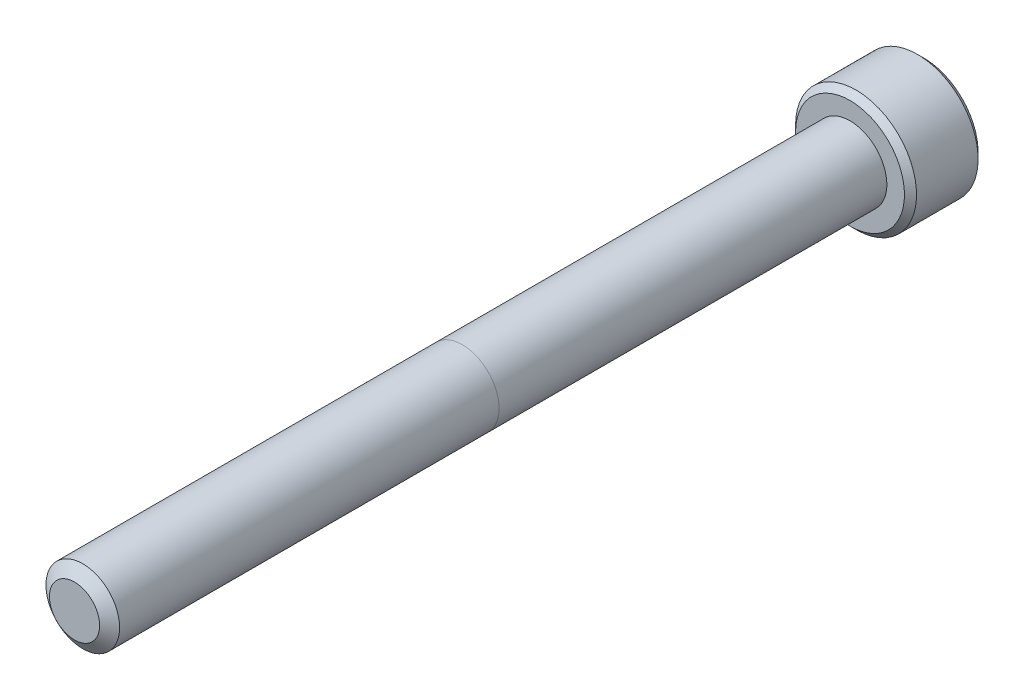
ISO-10303-21;
HEADER;
FILE_DESCRIPTION(('STEP AP214'),'2;1');
FILE_NAME('part.step','',(''),(''),'','','');
FILE_SCHEMA(('AUTOMOTIVE_DESIGN { 1 0 10303 214 1 1 1 1 }'));
ENDSEC;
DATA;
#1=APPLICATION_CONTEXT('core data for automotive mechanical design processes');
#2=APPLICATION_PROTOCOL_DEFINITION('international standard','automotive_design',2000,#1);
#3=PRODUCT_CONTEXT('',#1,'mechanical');
#4=PRODUCT('Part','Part','',(#3));
#5=PRODUCT_RELATED_PRODUCT_CATEGORY('part','',(#4));
#6=PRODUCT_DEFINITION_FORMATION('','',#4);
#7=PRODUCT_DEFINITION_CONTEXT('part definition',#1,'design');
#8=PRODUCT_DEFINITION('design','',#6,#7);
#9=PRODUCT_DEFINITION_SHAPE('','',#8);
#10=(LENGTH_UNIT() NAMED_UNIT(*) SI_UNIT(.MILLI.,.METRE.));
#11=(NAMED_UNIT(*) PLANE_ANGLE_UNIT() SI_UNIT($,.RADIAN.));
#12=(NAMED_UNIT(*) SI_UNIT($,.STERADIAN.) SOLID_ANGLE_UNIT());
#13=UNCERTAINTY_MEASURE_WITH_UNIT(LENGTH_MEASURE(1.E-05),#10,'distance_accuracy_value','');
#14=(GEOMETRIC_REPRESENTATION_CONTEXT(3) GLOBAL_UNCERTAINTY_ASSIGNED_CONTEXT((#13)) GLOBAL_UNIT_ASSIGNED_CONTEXT((#10,
#11,#12)) REPRESENTATION_CONTEXT('',''));
#15=CARTESIAN_POINT('',(0.,0.,0.));
#16=DIRECTION('',(0.,0.,1.));
#17=DIRECTION('',(1.,0.,0.));
#18=AXIS2_PLACEMENT_3D('',#15,#16,#17);
#19=CARTESIAN_POINT('',(0.,0.,-50.8));
#20=DIRECTION('',(0.,0.,1.));
#21=DIRECTION('',(1.,0.,0.));
#22=AXIS2_PLACEMENT_3D('',#19,#20,#21);
#23=CYLINDRICAL_SURFACE('',#22,2.413);
#24=CARTESIAN_POINT('',(0.,0.,-0.538848735955547));
#25=DIRECTION('',(0.,0.,1.));
#26=DIRECTION('',(1.,0.,0.));
#27=AXIS2_PLACEMENT_3D('',#24,#25,#26);
#28=CIRCLE('',#27,2.413);
#29=CARTESIAN_POINT('',(2.413,0.,-0.538848735955547));
#30=VERTEX_POINT('',#29);
#31=EDGE_CURVE('E111',#30,#30,#28,.T.);
#32=ORIENTED_EDGE('',*,*,#31,.F.);
#33=EDGE_LOOP('',(#32));
#34=FACE_BOUND('',#33,.T.);
#35=CARTESIAN_POINT('',(0.,0.,-25.4));
#36=DIRECTION('',(0.,0.,-1.));
#37=DIRECTION('',(-1.,0.,0.));
#38=AXIS2_PLACEMENT_3D('',#35,#36,#37);
#39=CIRCLE('',#38,2.413);
#40=CARTESIAN_POINT('',(2.413,0.,-25.4));
#41=VERTEX_POINT('',#40);
#42=CARTESIAN_POINT('',(-2.413,0.,-25.4));
#43=VERTEX_POINT('',#42);
#44=EDGE_CURVE('E38',#41,#43,#39,.F.);
#45=ORIENTED_EDGE('',*,*,#44,.T.);
#46=EDGE_CURVE('E11',#43,#41,#39,.F.);
#47=ORIENTED_EDGE('',*,*,#46,.T.);
#48=EDGE_LOOP('',(#45,#47));
#49=FACE_BOUND('',#48,.T.);
#50=ADVANCED_FACE('F34',(#34,#49),#23,.T.);
#51=ORIENTED_EDGE('',*,*,#46,.F.);
#52=ORIENTED_EDGE('',*,*,#44,.F.);
#53=EDGE_LOOP('',(#51,#52));
#54=FACE_BOUND('',#53,.T.);
#55=CARTESIAN_POINT('',(0.,0.,-50.8));
#56=DIRECTION('',(0.,0.,-1.));
#57=DIRECTION('',(-1.,0.,0.));
#58=AXIS2_PLACEMENT_3D('',#55,#56,#57);
#59=CIRCLE('',#58,2.413);
#60=CARTESIAN_POINT('',(-2.413,0.,-50.8));
#61=VERTEX_POINT('',#60);
#62=EDGE_CURVE('E195',#61,#61,#59,.F.);
#63=ORIENTED_EDGE('',*,*,#62,.T.);
#64=EDGE_LOOP('',(#63));
#65=FACE_BOUND('',#64,.T.);
#66=ADVANCED_FACE('F188',(#54,#65),#23,.T.);
#67=CARTESIAN_POINT('',(0.,0.,0.));
#68=DIRECTION('',(0.,0.,-1.));
#69=DIRECTION('',(-1.,0.,0.));
#70=AXIS2_PLACEMENT_3D('',#67,#68,#69);
#71=CONICAL_SURFACE('',#70,1.64344425180957,0.959931088596884);
#72=ORIENTED_EDGE('',*,*,#31,.T.);
#73=EDGE_LOOP('',(#72));
#74=FACE_BOUND('',#73,.T.);
#75=CARTESIAN_POINT('',(0.,0.,0.));
#76=DIRECTION('',(0.,0.,1.));
#77=DIRECTION('',(1.,0.,0.));
#78=AXIS2_PLACEMENT_3D('',#75,#76,#77);
#79=CIRCLE('',#78,1.64344425180957);
#80=CARTESIAN_POINT('',(1.64344425180957,0.,0.));
#81=VERTEX_POINT('',#80);
#82=EDGE_CURVE('E197',#81,#81,#79,.T.);
#83=ORIENTED_EDGE('',*,*,#82,.F.);
#84=EDGE_LOOP('',(#83));
#85=FACE_BOUND('',#84,.T.);
#86=ADVANCED_FACE('F191',(#74,#85),#71,.T.);
#87=CARTESIAN_POINT('',(0.,0.,0.));
#88=DIRECTION('',(0.,0.,1.));
#89=DIRECTION('',(1.,0.,0.));
#90=AXIS2_PLACEMENT_3D('',#87,#88,#89);
#91=PLANE('',#90);
#92=ORIENTED_EDGE('',*,*,#82,.T.);
#93=EDGE_LOOP('',(#92));
#94=FACE_BOUND('',#93,.T.);
#95=ADVANCED_FACE('F256',(#94),#91,.T.);
#96=CARTESIAN_POINT('',(0.,0.,-55.626));
#97=DIRECTION('',(0.,0.,1.));
#98=DIRECTION('',(1.,0.,0.));
#99=AXIS2_PLACEMENT_3D('',#96,#97,#98);
#100=CYLINDRICAL_SURFACE('',#99,3.9624);
#101=CARTESIAN_POINT('',(0.,0.,-55.22976));
#102=DIRECTION('',(0.,0.,-1.));
#103=DIRECTION('',(-1.,0.,0.));
#104=AXIS2_PLACEMENT_3D('',#101,#102,#103);
#105=CIRCLE('',#104,3.9624);
#106=CARTESIAN_POINT('',(-3.9624,0.,-55.22976));
#107=VERTEX_POINT('',#106);
#108=EDGE_CURVE('E179',#107,#107,#105,.F.);
#109=ORIENTED_EDGE('',*,*,#108,.T.);
#110=EDGE_LOOP('',(#109));
#111=FACE_BOUND('',#110,.T.);
#112=CARTESIAN_POINT('',(0.,0.,-51.19624));
#113=DIRECTION('',(0.,0.,-1.));
#114=DIRECTION('',(-1.,0.,0.));
#115=AXIS2_PLACEMENT_3D('',#112,#113,#114);
#116=CIRCLE('',#115,3.9624);
#117=CARTESIAN_POINT('',(-3.9624,0.,-51.19624));
#118=VERTEX_POINT('',#117);
#119=EDGE_CURVE('E176',#118,#118,#116,.T.);
#120=ORIENTED_EDGE('',*,*,#119,.T.);
#121=EDGE_LOOP('',(#120));
#122=FACE_BOUND('',#121,.T.);
#123=ADVANCED_FACE('F272',(#111,#122),#100,.T.);
#124=CARTESIAN_POINT('',(0.,0.,-55.626));
#125=DIRECTION('',(0.,0.,-1.));
#126=DIRECTION('',(-1.,0.,0.));
#127=AXIS2_PLACEMENT_3D('',#124,#125,#126);
#128=PLANE('',#127);
#129=CARTESIAN_POINT('',(0.,0.,-55.626));
#130=DIRECTION('',(0.,0.,-1.));
#131=DIRECTION('',(-1.,0.,0.));
#132=AXIS2_PLACEMENT_3D('',#129,#130,#131);
#133=CIRCLE('',#132,3.56616);
#134=CARTESIAN_POINT('',(-3.56616,0.,-55.626));
#135=VERTEX_POINT('',#134);
#136=EDGE_CURVE('E110',#135,#135,#133,.T.);
#137=ORIENTED_EDGE('',*,*,#136,.T.);
#138=EDGE_LOOP('',(#137));
#139=FACE_BOUND('',#138,.T.);
#140=CARTESIAN_POINT('',(0.,0.,-55.626));
#141=DIRECTION('',(0.,0.,-1.));
#142=DIRECTION('',(-1.,0.,0.));
#143=AXIS2_PLACEMENT_3D('',#140,#141,#142);
#144=CIRCLE('',#143,2.29135888084633);
#145=CARTESIAN_POINT('',(-1.984375,1.14567944042316,-55.626));
#146=VERTEX_POINT('',#145);
#147=CARTESIAN_POINT('',(0.,2.29135888084633,-55.626));
#148=VERTEX_POINT('',#147);
#149=EDGE_CURVE('E89',#146,#148,#144,.T.);
#150=ORIENTED_EDGE('',*,*,#149,.F.);
#151=CARTESIAN_POINT('',(-1.984375,-1.14567944042316,-55.626));
#152=VERTEX_POINT('',#151);
#153=EDGE_CURVE('E101',#152,#146,#144,.T.);
#154=ORIENTED_EDGE('',*,*,#153,.F.);
#155=CARTESIAN_POINT('',(0.,-2.29135888084633,-55.626));
#156=VERTEX_POINT('',#155);
#157=EDGE_CURVE('E435',#156,#152,#144,.T.);
#158=ORIENTED_EDGE('',*,*,#157,.F.);
#159=CARTESIAN_POINT('',(1.984375,-1.14567944042316,-55.626));
#160=VERTEX_POINT('',#159);
#161=EDGE_CURVE('E134',#160,#156,#144,.T.);
#162=ORIENTED_EDGE('',*,*,#161,.F.);
#163=CARTESIAN_POINT('',(1.984375,1.14567944042316,-55.626));
#164=VERTEX_POINT('',#163);
#165=EDGE_CURVE('E133',#164,#160,#144,.T.);
#166=ORIENTED_EDGE('',*,*,#165,.F.);
#167=EDGE_CURVE('E99',#148,#164,#144,.T.);
#168=ORIENTED_EDGE('',*,*,#167,.F.);
#169=EDGE_LOOP('',(#150,#154,#158,#162,#166,#168));
#170=FACE_BOUND('',#169,.T.);
#171=ADVANCED_FACE('F131',(#139,#170),#128,.T.);
#172=CARTESIAN_POINT('',(0.,0.,-50.8));
#173=DIRECTION('',(0.,0.,-1.));
#174=DIRECTION('',(-1.,0.,0.));
#175=AXIS2_PLACEMENT_3D('',#172,#173,#174);
#176=PLANE('',#175);
#177=CARTESIAN_POINT('',(0.,0.,-50.8));
#178=DIRECTION('',(0.,0.,-1.));
#179=DIRECTION('',(-1.,0.,0.));
#180=AXIS2_PLACEMENT_3D('',#177,#178,#179);
#181=CIRCLE('',#180,3.56616);
#182=CARTESIAN_POINT('',(-3.56616,0.,-50.8));
#183=VERTEX_POINT('',#182);
#184=EDGE_CURVE('E181',#183,#183,#181,.F.);
#185=ORIENTED_EDGE('',*,*,#184,.T.);
#186=EDGE_LOOP('',(#185));
#187=FACE_BOUND('',#186,.T.);
#188=ORIENTED_EDGE('',*,*,#62,.F.);
#189=EDGE_LOOP('',(#188));
#190=FACE_BOUND('',#189,.T.);
#191=ADVANCED_FACE('F271',(#187,#190),#176,.F.);
#192=CARTESIAN_POINT('',(0.,0.,-55.626));
#193=DIRECTION('',(0.,0.,-1.));
#194=DIRECTION('',(-1.,0.,0.));
#195=AXIS2_PLACEMENT_3D('',#192,#193,#194);
#196=CONICAL_SURFACE('',#195,2.29135888084633,0.78539816339745);
#197=ORIENTED_EDGE('',*,*,#167,.T.);
#198=CARTESIAN_POINT('',(-0.000199999999999745,2.29147435090016,-55.6261154787818));
#199=CARTESIAN_POINT('',(0.0680159951668045,2.25208982772757,-55.5867628522639));
#200=CARTESIAN_POINT('',(0.137372685106968,2.21204672412052,-55.5497213104462));
#201=CARTESIAN_POINT('',(0.278798800452189,2.13039431835551,-55.4818988584233));
#202=CARTESIAN_POINT('',(0.350881678736783,2.08877724917394,-55.4511556890917));
#203=CARTESIAN_POINT('',(0.496233397266003,2.00485839535392,-55.3984918888112));
#204=CARTESIAN_POINT('',(0.569465212486938,1.96257798712287,-55.37643887588));
#205=CARTESIAN_POINT('',(0.717541182594708,1.87708628592063,-55.3424614929439));
#206=CARTESIAN_POINT('',(0.792380812753428,1.83387760530244,-55.3305117560917));
#207=CARTESIAN_POINT('',(0.92136041454382,1.75941119748879,-55.3197300990819));
#208=CARTESIAN_POINT('',(0.975333715772447,1.72824969749539,-55.3181338990591));
#209=CARTESIAN_POINT('',(1.08319211851981,1.66597761963484,-55.3208218388653));
#210=CARTESIAN_POINT('',(1.13707718248553,1.63486706344893,-55.3251080403405));
#211=CARTESIAN_POINT('',(1.24433853824861,1.57293969082547,-55.3393168730135));
#212=CARTESIAN_POINT('',(1.29771419276014,1.54212324232506,-55.3492458104523));
#213=CARTESIAN_POINT('',(1.4035425174089,1.48102323060121,-55.3741950842745));
#214=CARTESIAN_POINT('',(1.45599525797111,1.45073962671789,-55.3892150303895));
#215=CARTESIAN_POINT('',(1.59035733896365,1.37316564308797,-55.4338078516357));
#216=CARTESIAN_POINT('',(1.67143335715833,1.32635638215845,-55.4667429959383));
#217=CARTESIAN_POINT('',(1.79064830672984,1.25752759893191,-55.5223424412022));
#218=CARTESIAN_POINT('',(1.829934924386,1.23484545965257,-55.5418775920519));
#219=CARTESIAN_POINT('',(1.90778036186805,1.18990137536713,-55.5827287381194));
#220=CARTESIAN_POINT('',(1.9463396111017,1.16763918244233,-55.6040436395683));
#221=CARTESIAN_POINT('',(1.984575,1.14556397036933,-55.6261154787818));
#222=B_SPLINE_CURVE_WITH_KNOTS('',3,(#198,#199,#200,#201,#202,#203,#204,#205,#206,#207,#208,
#209,#210,#211,#212,#213,#214,#215,#216,#217,#218,#219,#220,#221),.UNSPECIFIED.,.F.,.F.,(4,2,2,
2,2,2,2,2,2,2,2,4),(0.,0.264339630306627,0.530219665093693,0.791876416371459,1.0528742441811,
1.23963984393201,1.42647091743853,1.61351120244035,1.80053715247541,2.09764209964316,
2.24579179873713,2.39385111134157),.UNSPECIFIED.);
#223=EDGE_CURVE('E105',#148,#164,#222,.T.);
#224=ORIENTED_EDGE('',*,*,#223,.F.);
#225=EDGE_LOOP('',(#197,#224));
#226=FACE_BOUND('',#225,.T.);
#227=ADVANCED_FACE('F106',(#226),#196,.F.);
#228=ORIENTED_EDGE('',*,*,#165,.T.);
#229=CARTESIAN_POINT('',(1.984375,-2.28495242157823,-56.3609840788166));
#230=CARTESIAN_POINT('',(1.984375,-2.22931635455402,-56.3189866855508));
#231=CARTESIAN_POINT('',(1.984375,-2.17336876548389,-56.2773960540763));
#232=CARTESIAN_POINT('',(1.984375,-2.06072770258171,-56.1952084614715));
#233=CARTESIAN_POINT('',(1.984375,-2.00403404503435,-56.154611752405));
#234=CARTESIAN_POINT('',(1.984375,-1.88936329173489,-56.0743035031747));
#235=CARTESIAN_POINT('',(1.984375,-1.83137965519348,-56.0346012588133));
#236=CARTESIAN_POINT('',(1.984375,-1.71442802137841,-55.9566851734013));
#237=CARTESIAN_POINT('',(1.984375,-1.65546009407228,-55.9184712271944));
#238=CARTESIAN_POINT('',(1.984375,-1.47005472306036,-55.8022528340136));
#239=CARTESIAN_POINT('',(1.984375,-1.34163909427884,-55.7273478868724));
#240=CARTESIAN_POINT('',(1.984375,-1.0784038470548,-55.5903302154397));
#241=CARTESIAN_POINT('',(1.984375,-0.943607781407429,-55.5281743664824));
#242=CARTESIAN_POINT('',(1.984375,-0.741275100444885,-55.4521325786886));
#243=CARTESIAN_POINT('',(1.984375,-0.676735408881098,-55.430308061326));
#244=CARTESIAN_POINT('',(1.984375,-0.546098118112763,-55.3918404635378));
#245=CARTESIAN_POINT('',(1.984375,-0.480000411919956,-55.3751977400655));
#246=CARTESIAN_POINT('',(1.984375,-0.347746170028531,-55.3482353808697));
#247=CARTESIAN_POINT('',(1.984375,-0.281612071479121,-55.3378074097359));
#248=CARTESIAN_POINT('',(1.984375,-0.148636620052348,-55.3234781473766));
#249=CARTESIAN_POINT('',(1.984375,-0.0817953907393204,-55.3195757342274));
#250=CARTESIAN_POINT('',(1.984375,0.0495156750890689,-55.3185870513327));
#251=CARTESIAN_POINT('',(1.984375,0.113983775102996,-55.321259178875));
#252=CARTESIAN_POINT('',(1.984375,0.242367515846182,-55.3327392104975));
#253=CARTESIAN_POINT('',(1.984375,0.306283102295925,-55.3415477106392));
#254=CARTESIAN_POINT('',(1.984375,0.434181040262189,-55.3649690213329));
#255=CARTESIAN_POINT('',(1.984375,0.498145026858314,-55.3796806062321));
#256=CARTESIAN_POINT('',(1.984375,0.624675616953012,-55.4141261814121));
#257=CARTESIAN_POINT('',(1.984375,0.687242336899693,-55.4338597514492));
#258=CARTESIAN_POINT('',(1.984375,0.884225483826093,-55.5034122372308));
#259=CARTESIAN_POINT('',(1.984375,1.01583674256469,-55.5611524112565));
#260=CARTESIAN_POINT('',(1.984375,1.27288659242653,-55.6895303365888));
#261=CARTESIAN_POINT('',(1.984375,1.39830088270481,-55.7602144249194));
#262=CARTESIAN_POINT('',(1.984375,1.57956687990223,-55.8705166638132));
#263=CARTESIAN_POINT('',(1.984375,1.63738271299425,-55.9069698294754));
#264=CARTESIAN_POINT('',(1.984375,1.75202215386203,-55.9814159632917));
#265=CARTESIAN_POINT('',(1.984375,1.80884568601363,-56.0194090480781));
#266=CARTESIAN_POINT('',(1.984375,1.92116923084257,-56.0963388088931));
#267=CARTESIAN_POINT('',(1.984375,1.97667624512255,-56.1352653130388));
#268=CARTESIAN_POINT('',(1.984375,2.08693170717168,-56.2141477461214));
#269=CARTESIAN_POINT('',(1.984375,2.14168035934794,-56.254103389024));
#270=CARTESIAN_POINT('',(1.984375,2.19611149046623,-56.2944806112854));
#271=B_SPLINE_CURVE_WITH_KNOTS('',3,(#229,#230,#231,#232,#233,#234,#235,#236,#237,#238,#239,
#240,#241,#242,#243,#244,#245,#246,#247,#248,#249,#250,#251,#252,#253,#254,#255,#256,#257,#258,
#259,#260,#261,#262,#263,#264,#265,#266,#267,#268,#269,#270),.UNSPECIFIED.,.F.,.F.,(4,2,2,2,2,2,
2,2,2,2,2,2,2,2,2,2,2,2,2,2,4),(0.,0.209126070008329,0.418304637356572,0.629103979977993,
0.839888401371185,1.28549951116127,1.72957750768351,1.93379389749972,2.13802435186699,
2.33858179514334,2.5391047535064,2.73236963400795,2.92565329006888,3.12231577097488,
3.31896180041346,3.74886295245173,4.18033428125364,4.38536017180293,4.59040161996385,
4.7937774916511,4.99709743524133),.UNSPECIFIED.);
#272=EDGE_CURVE('E98',#164,#160,#271,.F.);
#273=ORIENTED_EDGE('',*,*,#272,.F.);
#274=EDGE_LOOP('',(#228,#273));
#275=FACE_BOUND('',#274,.T.);
#276=ADVANCED_FACE('F372',(#275),#196,.F.);
#277=ORIENTED_EDGE('',*,*,#161,.T.);
#278=CARTESIAN_POINT('',(1.984575,-1.14556397036933,-55.6261154787818));
#279=CARTESIAN_POINT('',(1.9163590048332,-1.18494849354192,-55.5867628522639));
#280=CARTESIAN_POINT('',(1.84700231489303,-1.22499159714897,-55.5497213104462));
#281=CARTESIAN_POINT('',(1.70557619954781,-1.30664400291398,-55.4818988584233));
#282=CARTESIAN_POINT('',(1.63349332126322,-1.34826107209555,-55.4511556890917));
#283=CARTESIAN_POINT('',(1.488141602734,-1.43217992591557,-55.3984918888112));
#284=CARTESIAN_POINT('',(1.41490978751306,-1.47446033414663,-55.37643887588));
#285=CARTESIAN_POINT('',(1.26683381740529,-1.55995203534886,-55.3424614929439));
#286=CARTESIAN_POINT('',(1.19199418724657,-1.60316071596705,-55.3305117560917));
#287=CARTESIAN_POINT('',(1.06301458545618,-1.6776271237807,-55.3197300990819));
#288=CARTESIAN_POINT('',(1.00904128422755,-1.7087886237741,-55.3181338990591));
#289=CARTESIAN_POINT('',(0.901182881480194,-1.77106070163465,-55.3208218388653));
#290=CARTESIAN_POINT('',(0.847297817514471,-1.80217125782056,-55.3251080403405));
#291=CARTESIAN_POINT('',(0.740036461751391,-1.86409863044402,-55.3393168730135));
#292=CARTESIAN_POINT('',(0.686660807239855,-1.89491507894443,-55.3492458104523));
#293=CARTESIAN_POINT('',(0.580832482591099,-1.95601509066828,-55.3741950842745));
#294=CARTESIAN_POINT('',(0.528379742028894,-1.9862986945516,-55.3892150303895));
#295=CARTESIAN_POINT('',(0.394017661036348,-2.06387267818152,-55.4338078516357));
#296=CARTESIAN_POINT('',(0.312941642841674,-2.11068193911104,-55.4667429959383));
#297=CARTESIAN_POINT('',(0.193726693270161,-2.17951072233758,-55.5223424412022));
#298=CARTESIAN_POINT('',(0.154440075614,-2.20219286161692,-55.5418775920519));
#299=CARTESIAN_POINT('',(0.0765946381319483,-2.24713694590236,-55.5827287381194));
#300=CARTESIAN_POINT('',(0.0380353888983028,-2.26939913882716,-55.6040436395683));
#301=CARTESIAN_POINT('',(-0.000199999999998482,-2.29147435090016,-55.6261154787818));
#302=B_SPLINE_CURVE_WITH_KNOTS('',3,(#278,#279,#280,#281,#282,#283,#284,#285,#286,#287,#288,
#289,#290,#291,#292,#293,#294,#295,#296,#297,#298,#299,#300,#301),.UNSPECIFIED.,.F.,.F.,(4,2,2,
2,2,2,2,2,2,2,2,4),(0.,0.264339630306623,0.530219665093693,0.791876416371462,1.0528742441811,
1.23963984393201,1.42647091743853,1.61351120244035,1.80053715247541,2.09764209964316,
2.24579179873713,2.39385111134157),.UNSPECIFIED.);
#303=EDGE_CURVE('E144',#160,#156,#302,.T.);
#304=ORIENTED_EDGE('',*,*,#303,.F.);
#305=EDGE_LOOP('',(#277,#304));
#306=FACE_BOUND('',#305,.T.);
#307=ADVANCED_FACE('F364',(#306),#196,.F.);
#308=ORIENTED_EDGE('',*,*,#157,.T.);
#309=CARTESIAN_POINT('',(0.000200000000000473,-2.29147435090016,-55.6261154787818));
#310=CARTESIAN_POINT('',(-0.0680159951668034,-2.25208982772757,-55.5867628522639));
#311=CARTESIAN_POINT('',(-0.137372685106967,-2.21204672412052,-55.5497213104462));
#312=CARTESIAN_POINT('',(-0.278798800452189,-2.13039431835551,-55.4818988584233));
#313=CARTESIAN_POINT('',(-0.350881678736785,-2.08877724917394,-55.4511556890917));
#314=CARTESIAN_POINT('',(-0.496233397266007,-2.00485839535391,-55.3984918888112));
#315=CARTESIAN_POINT('',(-0.569465212486942,-1.96257798712286,-55.37643887588));
#316=CARTESIAN_POINT('',(-0.71754118259471,-1.87708628592063,-55.3424614929439));
#317=CARTESIAN_POINT('',(-0.792380812753428,-1.83387760530244,-55.3305117560917));
#318=CARTESIAN_POINT('',(-0.92136041454382,-1.75941119748879,-55.3197300990819));
#319=CARTESIAN_POINT('',(-0.975333715772446,-1.72824969749539,-55.3181338990591));
#320=CARTESIAN_POINT('',(-1.0831921185198,-1.66597761963484,-55.3208218388653));
#321=CARTESIAN_POINT('',(-1.13707718248553,-1.63486706344893,-55.3251080403405));
#322=CARTESIAN_POINT('',(-1.24433853824861,-1.57293969082547,-55.3393168730135));
#323=CARTESIAN_POINT('',(-1.29771419276014,-1.54212324232506,-55.3492458104523));
#324=CARTESIAN_POINT('',(-1.4035425174089,-1.48102323060121,-55.3741950842745));
#325=CARTESIAN_POINT('',(-1.45599525797111,-1.45073962671789,-55.3892150303895));
#326=CARTESIAN_POINT('',(-1.59035733896365,-1.37316564308797,-55.4338078516357));
#327=CARTESIAN_POINT('',(-1.67143335715833,-1.32635638215845,-55.4667429959383));
#328=CARTESIAN_POINT('',(-1.79064830672984,-1.25752759893191,-55.5223424412022));
#329=CARTESIAN_POINT('',(-1.829934924386,-1.23484545965257,-55.5418775920519));
#330=CARTESIAN_POINT('',(-1.90778036186805,-1.18990137536713,-55.5827287381194));
#331=CARTESIAN_POINT('',(-1.94633961110169,-1.16763918244233,-55.6040436395683));
#332=CARTESIAN_POINT('',(-1.984575,-1.14556397036933,-55.6261154787818));
#333=B_SPLINE_CURVE_WITH_KNOTS('',3,(#309,#310,#311,#312,#313,#314,#315,#316,#317,#318,#319,
#320,#321,#322,#323,#324,#325,#326,#327,#328,#329,#330,#331,#332),.UNSPECIFIED.,.F.,.F.,(4,2,2,
2,2,2,2,2,2,2,2,4),(0.,0.264339630306627,0.530219665093698,0.791876416371464,1.0528742441811,
1.23963984393201,1.42647091743853,1.61351120244035,1.80053715247541,2.09764209964316,
2.24579179873713,2.39385111134157),.UNSPECIFIED.);
#334=EDGE_CURVE('E233',#156,#152,#333,.T.);
#335=ORIENTED_EDGE('',*,*,#334,.F.);
#336=EDGE_LOOP('',(#308,#335));
#337=FACE_BOUND('',#336,.T.);
#338=ADVANCED_FACE('F356',(#337),#196,.F.);
#339=ORIENTED_EDGE('',*,*,#153,.T.);
#340=CARTESIAN_POINT('',(-1.984375,-2.28495242157823,-56.3609840788166));
#341=CARTESIAN_POINT('',(-1.984375,-2.22931635455402,-56.3189866855508));
#342=CARTESIAN_POINT('',(-1.984375,-2.17336876548389,-56.2773960540763));
#343=CARTESIAN_POINT('',(-1.984375,-2.06072770258171,-56.1952084614715));
#344=CARTESIAN_POINT('',(-1.984375,-2.00403404503435,-56.154611752405));
#345=CARTESIAN_POINT('',(-1.984375,-1.88936329173489,-56.0743035031747));
#346=CARTESIAN_POINT('',(-1.984375,-1.83137965519348,-56.0346012588133));
#347=CARTESIAN_POINT('',(-1.984375,-1.71442802137841,-55.9566851734013));
#348=CARTESIAN_POINT('',(-1.984375,-1.65546009407228,-55.9184712271944));
#349=CARTESIAN_POINT('',(-1.984375,-1.47005472306036,-55.8022528340136));
#350=CARTESIAN_POINT('',(-1.984375,-1.34163909427884,-55.7273478868724));
#351=CARTESIAN_POINT('',(-1.984375,-1.0784038470548,-55.5903302154397));
#352=CARTESIAN_POINT('',(-1.984375,-0.943607781407429,-55.5281743664824));
#353=CARTESIAN_POINT('',(-1.984375,-0.741275100444885,-55.4521325786886));
#354=CARTESIAN_POINT('',(-1.984375,-0.676735408881098,-55.430308061326));
#355=CARTESIAN_POINT('',(-1.984375,-0.546098118112763,-55.3918404635378));
#356=CARTESIAN_POINT('',(-1.984375,-0.480000411919956,-55.3751977400655));
#357=CARTESIAN_POINT('',(-1.984375,-0.347746170028531,-55.3482353808697));
#358=CARTESIAN_POINT('',(-1.984375,-0.281612071479122,-55.3378074097359));
#359=CARTESIAN_POINT('',(-1.984375,-0.148636620052348,-55.3234781473766));
#360=CARTESIAN_POINT('',(-1.984375,-0.0817953907393205,-55.3195757342274));
#361=CARTESIAN_POINT('',(-1.984375,0.0495156750890688,-55.3185870513327));
#362=CARTESIAN_POINT('',(-1.984375,0.113983775102996,-55.321259178875));
#363=CARTESIAN_POINT('',(-1.984375,0.242367515846182,-55.3327392104975));
#364=CARTESIAN_POINT('',(-1.984375,0.306283102295925,-55.3415477106392));
#365=CARTESIAN_POINT('',(-1.984375,0.434181040262189,-55.3649690213329));
#366=CARTESIAN_POINT('',(-1.984375,0.498145026858314,-55.3796806062321));
#367=CARTESIAN_POINT('',(-1.984375,0.624675616953011,-55.4141261814121));
#368=CARTESIAN_POINT('',(-1.984375,0.687242336899693,-55.4338597514492));
#369=CARTESIAN_POINT('',(-1.984375,0.88422548382609,-55.5034122372308));
#370=CARTESIAN_POINT('',(-1.984375,1.01583674256468,-55.5611524112565));
#371=CARTESIAN_POINT('',(-1.984375,1.27288659242652,-55.6895303365888));
#372=CARTESIAN_POINT('',(-1.984375,1.3983008827048,-55.7602144249194));
#373=CARTESIAN_POINT('',(-1.984375,1.57956687990221,-55.8705166638132));
#374=CARTESIAN_POINT('',(-1.984375,1.63738271299424,-55.9069698294754));
#375=CARTESIAN_POINT('',(-1.984375,1.75202215386202,-55.9814159632917));
#376=CARTESIAN_POINT('',(-1.984375,1.80884568601362,-56.0194090480781));
#377=CARTESIAN_POINT('',(-1.984375,1.92116923084256,-56.0963388088931));
#378=CARTESIAN_POINT('',(-1.984375,1.97667624512254,-56.1352653130388));
#379=CARTESIAN_POINT('',(-1.984375,2.08693170717167,-56.2141477461214));
#380=CARTESIAN_POINT('',(-1.984375,2.14168035934793,-56.254103389024));
#381=CARTESIAN_POINT('',(-1.984375,2.19611149046623,-56.2944806112854));
#382=B_SPLINE_CURVE_WITH_KNOTS('',3,(#340,#341,#342,#343,#344,#345,#346,#347,#348,#349,#350,
#351,#352,#353,#354,#355,#356,#357,#358,#359,#360,#361,#362,#363,#364,#365,#366,#367,#368,#369,
#370,#371,#372,#373,#374,#375,#376,#377,#378,#379,#380,#381),.UNSPECIFIED.,.F.,.F.,(4,2,2,2,2,2,
2,2,2,2,2,2,2,2,2,2,2,2,2,2,4),(0.,0.209126070008329,0.418304637356572,0.629103979977993,
0.839888401371185,1.28549951116127,1.72957750768351,1.93379389749972,2.13802435186699,
2.33858179514334,2.5391047535064,2.73236963400795,2.92565329006888,3.12231577097488,
3.31896180041346,3.74886295245173,4.18033428125363,4.38536017180291,4.59040161996384,
4.79377749165109,4.99709743524133),.UNSPECIFIED.);
#383=EDGE_CURVE('E121',#152,#146,#382,.T.);
#384=ORIENTED_EDGE('',*,*,#383,.F.);
#385=EDGE_LOOP('',(#339,#384));
#386=FACE_BOUND('',#385,.T.);
#387=ADVANCED_FACE('F348',(#386),#196,.F.);
#388=ORIENTED_EDGE('',*,*,#149,.T.);
#389=CARTESIAN_POINT('',(-1.984575,1.14556397036933,-55.6261154787818));
#390=CARTESIAN_POINT('',(-1.9163590048332,1.18494849354192,-55.5867628522639));
#391=CARTESIAN_POINT('',(-1.84700231489303,1.22499159714897,-55.5497213104462));
#392=CARTESIAN_POINT('',(-1.70557619954781,1.30664400291398,-55.4818988584233));
#393=CARTESIAN_POINT('',(-1.63349332126321,1.34826107209556,-55.4511556890917));
#394=CARTESIAN_POINT('',(-1.48814160273399,1.43217992591558,-55.3984918888112));
#395=CARTESIAN_POINT('',(-1.41490978751306,1.47446033414663,-55.37643887588));
#396=CARTESIAN_POINT('',(-1.26683381740529,1.55995203534886,-55.3424614929439));
#397=CARTESIAN_POINT('',(-1.19199418724657,1.60316071596705,-55.3305117560917));
#398=CARTESIAN_POINT('',(-1.06301458545618,1.6776271237807,-55.3197300990819));
#399=CARTESIAN_POINT('',(-1.00904128422755,1.7087886237741,-55.3181338990591));
#400=CARTESIAN_POINT('',(-0.901182881480195,1.77106070163465,-55.3208218388653));
#401=CARTESIAN_POINT('',(-0.847297817514472,1.80217125782056,-55.3251080403405));
#402=CARTESIAN_POINT('',(-0.740036461751392,1.86409863044402,-55.3393168730135));
#403=CARTESIAN_POINT('',(-0.686660807239855,1.89491507894443,-55.3492458104523));
#404=CARTESIAN_POINT('',(-0.580832482591099,1.95601509066828,-55.3741950842745));
#405=CARTESIAN_POINT('',(-0.528379742028894,1.9862986945516,-55.3892150303895));
#406=CARTESIAN_POINT('',(-0.394017661036348,2.06387267818152,-55.4338078516357));
#407=CARTESIAN_POINT('',(-0.312941642841674,2.11068193911104,-55.4667429959383));
#408=CARTESIAN_POINT('',(-0.193726693270161,2.17951072233758,-55.5223424412022));
#409=CARTESIAN_POINT('',(-0.154440075613999,2.20219286161692,-55.5418775920519));
#410=CARTESIAN_POINT('',(-0.0765946381319479,2.24713694590236,-55.5827287381194));
#411=CARTESIAN_POINT('',(-0.0380353888983024,2.26939913882716,-55.6040436395683));
#412=CARTESIAN_POINT('',(0.000199999999998893,2.29147435090016,-55.6261154787818));
#413=B_SPLINE_CURVE_WITH_KNOTS('',3,(#389,#390,#391,#392,#393,#394,#395,#396,#397,#398,#399,
#400,#401,#402,#403,#404,#405,#406,#407,#408,#409,#410,#411,#412),.UNSPECIFIED.,.F.,.F.,(4,2,2,
2,2,2,2,2,2,2,2,4),(0.,0.264339630306628,0.530219665093698,0.791876416371465,1.0528742441811,
1.23963984393201,1.42647091743853,1.61351120244035,1.80053715247541,2.09764209964316,
2.24579179873714,2.39385111134157),.UNSPECIFIED.);
#414=EDGE_CURVE('E93',#146,#148,#413,.T.);
#415=ORIENTED_EDGE('',*,*,#414,.F.);
#416=EDGE_LOOP('',(#388,#415));
#417=FACE_BOUND('',#416,.T.);
#418=ADVANCED_FACE('F91',(#417),#196,.F.);
#419=CARTESIAN_POINT('',(1.984375,3.43703832126949,-52.6494375));
#420=DIRECTION('',(0.,0.,-1.));
#421=DIRECTION('',(-1.,0.,0.));
#422=AXIS2_PLACEMENT_3D('',#419,#420,#421);
#423=PLANE('',#422);
#424=DIRECTION('',(0.866025403784439,0.5,0.));
#425=VECTOR('',#424,1.);
#426=CARTESIAN_POINT('',(-1.984375,1.14567944042316,-52.6494375));
#427=LINE('',#426,#425);
#428=CARTESIAN_POINT('',(-1.984375,1.14567944042316,-52.6494375));
#429=VERTEX_POINT('',#428);
#430=CARTESIAN_POINT('',(0.,2.29135888084633,-52.6494375));
#431=VERTEX_POINT('',#430);
#432=EDGE_CURVE('E120',#429,#431,#427,.T.);
#433=ORIENTED_EDGE('',*,*,#432,.T.);
#434=DIRECTION('',(0.866025403784439,-0.5,0.));
#435=VECTOR('',#434,1.);
#436=CARTESIAN_POINT('',(0.,2.29135888084633,-52.6494375));
#437=LINE('',#436,#435);
#438=CARTESIAN_POINT('',(1.984375,1.14567944042316,-52.6494375));
#439=VERTEX_POINT('',#438);
#440=EDGE_CURVE('E125',#431,#439,#437,.T.);
#441=ORIENTED_EDGE('',*,*,#440,.T.);
#442=DIRECTION('',(0.,-1.,0.));
#443=VECTOR('',#442,1.);
#444=CARTESIAN_POINT('',(1.984375,1.14567944042316,-52.6494375));
#445=LINE('',#444,#443);
#446=CARTESIAN_POINT('',(1.984375,-1.14567944042316,-52.6494375));
#447=VERTEX_POINT('',#446);
#448=EDGE_CURVE('E219',#439,#447,#445,.T.);
#449=ORIENTED_EDGE('',*,*,#448,.T.);
#450=DIRECTION('',(-0.866025403784439,-0.5,0.));
#451=VECTOR('',#450,1.);
#452=CARTESIAN_POINT('',(1.984375,-1.14567944042316,-52.6494375));
#453=LINE('',#452,#451);
#454=CARTESIAN_POINT('',(0.,-2.29135888084633,-52.6494375));
#455=VERTEX_POINT('',#454);
#456=EDGE_CURVE('E216',#447,#455,#453,.T.);
#457=ORIENTED_EDGE('',*,*,#456,.T.);
#458=DIRECTION('',(-0.866025403784439,0.5,0.));
#459=VECTOR('',#458,1.);
#460=CARTESIAN_POINT('',(0.,-2.29135888084633,-52.6494375));
#461=LINE('',#460,#459);
#462=CARTESIAN_POINT('',(-1.984375,-1.14567944042316,-52.6494375));
#463=VERTEX_POINT('',#462);
#464=EDGE_CURVE('E213',#455,#463,#461,.T.);
#465=ORIENTED_EDGE('',*,*,#464,.T.);
#466=DIRECTION('',(0.,1.,0.));
#467=VECTOR('',#466,1.);
#468=CARTESIAN_POINT('',(-1.984375,-1.14567944042316,-52.6494375));
#469=LINE('',#468,#467);
#470=EDGE_CURVE('E128',#463,#429,#469,.T.);
#471=ORIENTED_EDGE('',*,*,#470,.T.);
#472=EDGE_LOOP('',(#433,#441,#449,#457,#465,#471));
#473=FACE_BOUND('',#472,.T.);
#474=ADVANCED_FACE('F164',(#473),#423,.T.);
#475=CARTESIAN_POINT('',(0.,2.29135888084633,-52.6494375));
#476=DIRECTION('',(0.5,0.866025403784439,0.));
#477=DIRECTION('',(-0.866025403784439,0.5,0.));
#478=AXIS2_PLACEMENT_3D('',#475,#476,#477);
#479=PLANE('',#478);
#480=DIRECTION('',(0.,0.,-1.));
#481=VECTOR('',#480,1.);
#482=CARTESIAN_POINT('',(0.,2.29135888084633,-52.6494375));
#483=LINE('',#482,#481);
#484=EDGE_CURVE('E117',#431,#148,#483,.T.);
#485=ORIENTED_EDGE('',*,*,#484,.T.);
#486=ORIENTED_EDGE('',*,*,#223,.T.);
#487=DIRECTION('',(0.,0.,-1.));
#488=VECTOR('',#487,1.);
#489=CARTESIAN_POINT('',(1.984375,1.14567944042316,-52.6494375));
#490=LINE('',#489,#488);
#491=EDGE_CURVE('E127',#439,#164,#490,.T.);
#492=ORIENTED_EDGE('',*,*,#491,.F.);
#493=ORIENTED_EDGE('',*,*,#440,.F.);
#494=EDGE_LOOP('',(#485,#486,#492,#493));
#495=FACE_BOUND('',#494,.T.);
#496=ADVANCED_FACE('F123',(#495),#479,.F.);
#497=CARTESIAN_POINT('',(1.984375,1.14567944042316,-52.6494375));
#498=DIRECTION('',(1.,0.,0.));
#499=DIRECTION('',(0.,0.,-1.));
#500=AXIS2_PLACEMENT_3D('',#497,#498,#499);
#501=PLANE('',#500);
#502=ORIENTED_EDGE('',*,*,#491,.T.);
#503=ORIENTED_EDGE('',*,*,#272,.T.);
#504=DIRECTION('',(0.,0.,-1.));
#505=VECTOR('',#504,1.);
#506=CARTESIAN_POINT('',(1.984375,-1.14567944042316,-52.6494375));
#507=LINE('',#506,#505);
#508=EDGE_CURVE('E204',#447,#160,#507,.T.);
#509=ORIENTED_EDGE('',*,*,#508,.F.);
#510=ORIENTED_EDGE('',*,*,#448,.F.);
#511=EDGE_LOOP('',(#502,#503,#509,#510));
#512=FACE_BOUND('',#511,.T.);
#513=ADVANCED_FACE('F153',(#512),#501,.F.);
#514=CARTESIAN_POINT('',(1.984375,-1.14567944042316,-52.6494375));
#515=DIRECTION('',(0.5,-0.866025403784439,0.));
#516=DIRECTION('',(0.866025403784439,0.5,0.));
#517=AXIS2_PLACEMENT_3D('',#514,#515,#516);
#518=PLANE('',#517);
#519=ORIENTED_EDGE('',*,*,#508,.T.);
#520=ORIENTED_EDGE('',*,*,#303,.T.);
#521=DIRECTION('',(0.,0.,-1.));
#522=VECTOR('',#521,1.);
#523=CARTESIAN_POINT('',(0.,-2.29135888084633,-52.6494375));
#524=LINE('',#523,#522);
#525=EDGE_CURVE('E207',#455,#156,#524,.T.);
#526=ORIENTED_EDGE('',*,*,#525,.F.);
#527=ORIENTED_EDGE('',*,*,#456,.F.);
#528=EDGE_LOOP('',(#519,#520,#526,#527));
#529=FACE_BOUND('',#528,.T.);
#530=ADVANCED_FACE('F157',(#529),#518,.F.);
#531=CARTESIAN_POINT('',(0.,-2.29135888084633,-52.6494375));
#532=DIRECTION('',(-0.5,-0.866025403784439,0.));
#533=DIRECTION('',(0.866025403784439,-0.5,0.));
#534=AXIS2_PLACEMENT_3D('',#531,#532,#533);
#535=PLANE('',#534);
#536=ORIENTED_EDGE('',*,*,#525,.T.);
#537=ORIENTED_EDGE('',*,*,#334,.T.);
#538=DIRECTION('',(0.,0.,-1.));
#539=VECTOR('',#538,1.);
#540=CARTESIAN_POINT('',(-1.984375,-1.14567944042316,-52.6494375));
#541=LINE('',#540,#539);
#542=EDGE_CURVE('E200',#463,#152,#541,.T.);
#543=ORIENTED_EDGE('',*,*,#542,.F.);
#544=ORIENTED_EDGE('',*,*,#464,.F.);
#545=EDGE_LOOP('',(#536,#537,#543,#544));
#546=FACE_BOUND('',#545,.T.);
#547=ADVANCED_FACE('F241',(#546),#535,.F.);
#548=CARTESIAN_POINT('',(-1.984375,-1.14567944042316,-52.6494375));
#549=DIRECTION('',(-1.,0.,0.));
#550=DIRECTION('',(0.,0.,1.));
#551=AXIS2_PLACEMENT_3D('',#548,#549,#550);
#552=PLANE('',#551);
#553=ORIENTED_EDGE('',*,*,#542,.T.);
#554=ORIENTED_EDGE('',*,*,#383,.T.);
#555=DIRECTION('',(0.,0.,-1.));
#556=VECTOR('',#555,1.);
#557=CARTESIAN_POINT('',(-1.984375,1.14567944042316,-52.6494375));
#558=LINE('',#557,#556);
#559=EDGE_CURVE('E119',#429,#146,#558,.T.);
#560=ORIENTED_EDGE('',*,*,#559,.F.);
#561=ORIENTED_EDGE('',*,*,#470,.F.);
#562=EDGE_LOOP('',(#553,#554,#560,#561));
#563=FACE_BOUND('',#562,.T.);
#564=ADVANCED_FACE('F238',(#563),#552,.F.);
#565=CARTESIAN_POINT('',(-1.984375,1.14567944042316,-52.6494375));
#566=DIRECTION('',(-0.5,0.866025403784439,0.));
#567=DIRECTION('',(-0.866025403784439,-0.5,0.));
#568=AXIS2_PLACEMENT_3D('',#565,#566,#567);
#569=PLANE('',#568);
#570=ORIENTED_EDGE('',*,*,#559,.T.);
#571=ORIENTED_EDGE('',*,*,#414,.T.);
#572=ORIENTED_EDGE('',*,*,#484,.F.);
#573=ORIENTED_EDGE('',*,*,#432,.F.);
#574=EDGE_LOOP('',(#570,#571,#572,#573));
#575=FACE_BOUND('',#574,.T.);
#576=ADVANCED_FACE('F115',(#575),#569,.F.);
#577=CARTESIAN_POINT('',(0.,0.,-55.626));
#578=DIRECTION('',(0.,0.,1.));
#579=DIRECTION('',(1.,0.,0.));
#580=AXIS2_PLACEMENT_3D('',#577,#578,#579);
#581=CONICAL_SURFACE('',#580,3.56616,0.78539816339745);
#582=ORIENTED_EDGE('',*,*,#108,.F.);
#583=EDGE_LOOP('',(#582));
#584=FACE_BOUND('',#583,.T.);
#585=ORIENTED_EDGE('',*,*,#136,.F.);
#586=EDGE_LOOP('',(#585));
#587=FACE_BOUND('',#586,.T.);
#588=ADVANCED_FACE('F258',(#584,#587),#581,.T.);
#589=CARTESIAN_POINT('',(0.,0.,-51.19624));
#590=DIRECTION('',(0.,0.,-1.));
#591=DIRECTION('',(-1.,0.,0.));
#592=AXIS2_PLACEMENT_3D('',#589,#590,#591);
#593=CONICAL_SURFACE('',#592,3.9624,0.78539816339745);
#594=ORIENTED_EDGE('',*,*,#184,.F.);
#595=EDGE_LOOP('',(#594));
#596=FACE_BOUND('',#595,.T.);
#597=ORIENTED_EDGE('',*,*,#119,.F.);
#598=EDGE_LOOP('',(#597));
#599=FACE_BOUND('',#598,.T.);
#600=ADVANCED_FACE('F36',(#596,#599),#593,.T.);
#601=CLOSED_SHELL('',(#50,#66,#86,#95,#123,#171,#191,#227,#276,#307,#338,#387,#418,#474,#496,
#513,#530,#547,#564,#576,#588,#600));
#602=MANIFOLD_SOLID_BREP('B2',#601);
#603=ADVANCED_BREP_SHAPE_REPRESENTATION('',(#18,#602),#14);
#604=SHAPE_DEFINITION_REPRESENTATION(#9,#603);
ENDSEC;
END-ISO-10303-21;
